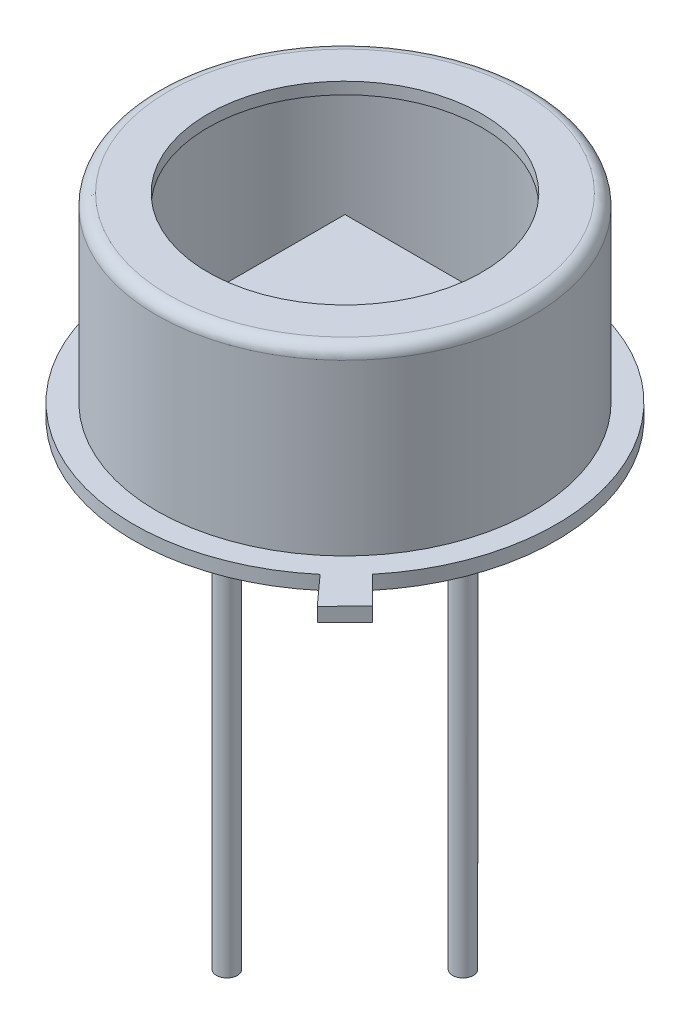
ISO-10303-21;
HEADER;
FILE_DESCRIPTION(('STEP AP214'),'2;1');
FILE_NAME('part.step','',(''),(''),'','','');
FILE_SCHEMA(('AUTOMOTIVE_DESIGN { 1 0 10303 214 1 1 1 1 }'));
ENDSEC;
DATA;
#1=APPLICATION_CONTEXT('core data for automotive mechanical design processes');
#2=APPLICATION_PROTOCOL_DEFINITION('international standard','automotive_design',2000,#1);
#3=PRODUCT_CONTEXT('',#1,'mechanical');
#4=PRODUCT('Part','Part','',(#3));
#5=PRODUCT_RELATED_PRODUCT_CATEGORY('part','',(#4));
#6=PRODUCT_DEFINITION_FORMATION('','',#4);
#7=PRODUCT_DEFINITION_CONTEXT('part definition',#1,'design');
#8=PRODUCT_DEFINITION('design','',#6,#7);
#9=PRODUCT_DEFINITION_SHAPE('','',#8);
#10=(LENGTH_UNIT() NAMED_UNIT(*) SI_UNIT(.MILLI.,.METRE.));
#11=(NAMED_UNIT(*) PLANE_ANGLE_UNIT() SI_UNIT($,.RADIAN.));
#12=(NAMED_UNIT(*) SI_UNIT($,.STERADIAN.) SOLID_ANGLE_UNIT());
#13=UNCERTAINTY_MEASURE_WITH_UNIT(LENGTH_MEASURE(1.E-05),#10,'distance_accuracy_value','');
#14=(GEOMETRIC_REPRESENTATION_CONTEXT(3) GLOBAL_UNCERTAINTY_ASSIGNED_CONTEXT((#13)) GLOBAL_UNIT_ASSIGNED_CONTEXT((#10,
#11,#12)) REPRESENTATION_CONTEXT('',''));
#15=CARTESIAN_POINT('',(0.,0.,0.));
#16=DIRECTION('',(0.,0.,1.));
#17=DIRECTION('',(1.,0.,0.));
#18=AXIS2_PLACEMENT_3D('',#15,#16,#17);
#19=CARTESIAN_POINT('',(-1.5,1.792,1.5));
#20=DIRECTION('',(1.,0.,0.));
#21=DIRECTION('',(0.,0.,-1.));
#22=AXIS2_PLACEMENT_3D('',#19,#20,#21);
#23=PLANE('',#22);
#24=DIRECTION('',(0.,0.,-1.));
#25=VECTOR('',#24,1.);
#26=CARTESIAN_POINT('',(-1.5,2.3,1.5));
#27=LINE('',#26,#25);
#28=CARTESIAN_POINT('',(-1.5,2.3,1.5));
#29=VERTEX_POINT('',#28);
#30=CARTESIAN_POINT('',(-1.5,2.3,-1.5));
#31=VERTEX_POINT('',#30);
#32=EDGE_CURVE('E114',#29,#31,#27,.T.);
#33=ORIENTED_EDGE('',*,*,#32,.T.);
#34=DIRECTION('',(0.,1.,0.));
#35=VECTOR('',#34,1.);
#36=CARTESIAN_POINT('',(-1.5,1.792,-1.5));
#37=LINE('',#36,#35);
#38=CARTESIAN_POINT('',(-1.5,1.792,-1.5));
#39=VERTEX_POINT('',#38);
#40=EDGE_CURVE('E12',#39,#31,#37,.T.);
#41=ORIENTED_EDGE('',*,*,#40,.F.);
#42=DIRECTION('',(0.,0.,-1.));
#43=VECTOR('',#42,1.);
#44=CARTESIAN_POINT('',(-1.5,1.792,1.5));
#45=LINE('',#44,#43);
#46=CARTESIAN_POINT('',(-1.5,1.792,1.5));
#47=VERTEX_POINT('',#46);
#48=EDGE_CURVE('E102',#47,#39,#45,.T.);
#49=ORIENTED_EDGE('',*,*,#48,.F.);
#50=DIRECTION('',(0.,1.,0.));
#51=VECTOR('',#50,1.);
#52=CARTESIAN_POINT('',(-1.5,1.792,1.5));
#53=LINE('',#52,#51);
#54=EDGE_CURVE('E110',#47,#29,#53,.T.);
#55=ORIENTED_EDGE('',*,*,#54,.T.);
#56=EDGE_LOOP('',(#33,#41,#49,#55));
#57=FACE_BOUND('',#56,.T.);
#58=ADVANCED_FACE('F51',(#57),#23,.F.);
#59=CARTESIAN_POINT('',(-1.5,1.792,-1.5));
#60=DIRECTION('',(0.,0.,1.));
#61=DIRECTION('',(1.,0.,0.));
#62=AXIS2_PLACEMENT_3D('',#59,#60,#61);
#63=PLANE('',#62);
#64=DIRECTION('',(1.,0.,0.));
#65=VECTOR('',#64,1.);
#66=CARTESIAN_POINT('',(-1.5,2.3,-1.5));
#67=LINE('',#66,#65);
#68=CARTESIAN_POINT('',(1.5,2.3,-1.5));
#69=VERTEX_POINT('',#68);
#70=EDGE_CURVE('E106',#31,#69,#67,.T.);
#71=ORIENTED_EDGE('',*,*,#70,.T.);
#72=DIRECTION('',(0.,1.,0.));
#73=VECTOR('',#72,1.);
#74=CARTESIAN_POINT('',(1.5,1.792,-1.5));
#75=LINE('',#74,#73);
#76=CARTESIAN_POINT('',(1.5,1.792,-1.5));
#77=VERTEX_POINT('',#76);
#78=EDGE_CURVE('E59',#77,#69,#75,.T.);
#79=ORIENTED_EDGE('',*,*,#78,.F.);
#80=DIRECTION('',(1.,0.,0.));
#81=VECTOR('',#80,1.);
#82=CARTESIAN_POINT('',(-1.5,1.792,-1.5));
#83=LINE('',#82,#81);
#84=EDGE_CURVE('E97',#39,#77,#83,.T.);
#85=ORIENTED_EDGE('',*,*,#84,.F.);
#86=ORIENTED_EDGE('',*,*,#40,.T.);
#87=EDGE_LOOP('',(#71,#79,#85,#86));
#88=FACE_BOUND('',#87,.T.);
#89=ADVANCED_FACE('F105',(#88),#63,.F.);
#90=CARTESIAN_POINT('',(1.5,1.792,1.5));
#91=DIRECTION('',(-1.,0.,0.));
#92=DIRECTION('',(0.,0.,1.));
#93=AXIS2_PLACEMENT_3D('',#90,#91,#92);
#94=PLANE('',#93);
#95=DIRECTION('',(0.,0.,1.));
#96=VECTOR('',#95,1.);
#97=CARTESIAN_POINT('',(1.5,2.3,1.5));
#98=LINE('',#97,#96);
#99=CARTESIAN_POINT('',(1.5,2.3,1.5));
#100=VERTEX_POINT('',#99);
#101=EDGE_CURVE('E84',#69,#100,#98,.T.);
#102=ORIENTED_EDGE('',*,*,#101,.T.);
#103=DIRECTION('',(0.,1.,0.));
#104=VECTOR('',#103,1.);
#105=CARTESIAN_POINT('',(1.5,1.792,1.5));
#106=LINE('',#105,#104);
#107=CARTESIAN_POINT('',(1.5,1.792,1.5));
#108=VERTEX_POINT('',#107);
#109=EDGE_CURVE('E107',#108,#100,#106,.T.);
#110=ORIENTED_EDGE('',*,*,#109,.F.);
#111=DIRECTION('',(0.,0.,1.));
#112=VECTOR('',#111,1.);
#113=CARTESIAN_POINT('',(1.5,1.792,1.5));
#114=LINE('',#113,#112);
#115=EDGE_CURVE('E100',#77,#108,#114,.T.);
#116=ORIENTED_EDGE('',*,*,#115,.F.);
#117=ORIENTED_EDGE('',*,*,#78,.T.);
#118=EDGE_LOOP('',(#102,#110,#116,#117));
#119=FACE_BOUND('',#118,.T.);
#120=ADVANCED_FACE('F108',(#119),#94,.F.);
#121=CARTESIAN_POINT('',(-1.5,1.792,1.5));
#122=DIRECTION('',(0.,0.,-1.));
#123=DIRECTION('',(-1.,0.,0.));
#124=AXIS2_PLACEMENT_3D('',#121,#122,#123);
#125=PLANE('',#124);
#126=DIRECTION('',(-1.,0.,0.));
#127=VECTOR('',#126,1.);
#128=CARTESIAN_POINT('',(-1.5,2.3,1.5));
#129=LINE('',#128,#127);
#130=EDGE_CURVE('E90',#100,#29,#129,.T.);
#131=ORIENTED_EDGE('',*,*,#130,.T.);
#132=ORIENTED_EDGE('',*,*,#54,.F.);
#133=DIRECTION('',(-1.,0.,0.));
#134=VECTOR('',#133,1.);
#135=CARTESIAN_POINT('',(-1.5,1.792,1.5));
#136=LINE('',#135,#134);
#137=EDGE_CURVE('E67',#108,#47,#136,.T.);
#138=ORIENTED_EDGE('',*,*,#137,.F.);
#139=ORIENTED_EDGE('',*,*,#109,.T.);
#140=EDGE_LOOP('',(#131,#132,#138,#139));
#141=FACE_BOUND('',#140,.T.);
#142=ADVANCED_FACE('F121',(#141),#125,.F.);
#143=CARTESIAN_POINT('',(-1.5,1.792,-1.5));
#144=DIRECTION('',(0.,-1.,0.));
#145=DIRECTION('',(0.,0.,-1.));
#146=AXIS2_PLACEMENT_3D('',#143,#144,#145);
#147=PLANE('',#146);
#148=ORIENTED_EDGE('',*,*,#48,.T.);
#149=ORIENTED_EDGE('',*,*,#84,.T.);
#150=ORIENTED_EDGE('',*,*,#115,.T.);
#151=ORIENTED_EDGE('',*,*,#137,.T.);
#152=EDGE_LOOP('',(#148,#149,#150,#151));
#153=FACE_BOUND('',#152,.T.);
#154=ADVANCED_FACE('F98',(#153),#147,.T.);
#155=CARTESIAN_POINT('',(-1.5,2.3,-1.5));
#156=DIRECTION('',(0.,-1.,0.));
#157=DIRECTION('',(0.,0.,-1.));
#158=AXIS2_PLACEMENT_3D('',#155,#156,#157);
#159=PLANE('',#158);
#160=ORIENTED_EDGE('',*,*,#32,.F.);
#161=ORIENTED_EDGE('',*,*,#130,.F.);
#162=ORIENTED_EDGE('',*,*,#101,.F.);
#163=ORIENTED_EDGE('',*,*,#70,.F.);
#164=EDGE_LOOP('',(#160,#161,#162,#163));
#165=FACE_BOUND('',#164,.T.);
#166=ADVANCED_FACE('F124',(#165),#159,.F.);
#167=CLOSED_SHELL('',(#58,#89,#120,#142,#154,#166));
#168=MANIFOLD_SOLID_BREP('B2',#167);
#169=CARTESIAN_POINT('',(4.55,0.,0.));
#170=DIRECTION('',(0.,1.,0.));
#171=DIRECTION('',(0.,0.,1.));
#172=AXIS2_PLACEMENT_3D('',#169,#170,#171);
#173=PLANE('',#172);
#174=CARTESIAN_POINT('',(-2.54,0.,0.));
#175=DIRECTION('',(0.,1.,0.));
#176=DIRECTION('',(0.,0.,1.));
#177=AXIS2_PLACEMENT_3D('',#174,#175,#176);
#178=CIRCLE('',#177,0.224999999999999);
#179=CARTESIAN_POINT('',(-2.54,0.,0.224999999999999));
#180=VERTEX_POINT('',#179);
#181=EDGE_CURVE('E281',#180,#180,#178,.F.);
#182=ORIENTED_EDGE('',*,*,#181,.F.);
#183=EDGE_LOOP('',(#182));
#184=FACE_BOUND('',#183,.T.);
#185=CARTESIAN_POINT('',(0.,0.,0.));
#186=DIRECTION('',(0.,-1.,0.));
#187=DIRECTION('',(0.,0.,-1.));
#188=AXIS2_PLACEMENT_3D('',#185,#186,#187);
#189=CIRCLE('',#188,4.55);
#190=CARTESIAN_POINT('',(2.93886579784095,0.,3.47355262264453));
#191=VERTEX_POINT('',#190);
#192=CARTESIAN_POINT('',(3.4991505641407,0.,2.90834064880197));
#193=VERTEX_POINT('',#192);
#194=EDGE_CURVE('E198',#191,#193,#189,.T.);
#195=ORIENTED_EDGE('',*,*,#194,.T.);
#196=DIRECTION('',(0.710195552739869,0.,0.70400445798909));
#197=VECTOR('',#196,1.);
#198=CARTESIAN_POINT('',(3.4991505641407,0.,2.90834064880197));
#199=LINE('',#198,#197);
#200=CARTESIAN_POINT('',(4.09684665660265,0.,3.50082635501703));
#201=VERTEX_POINT('',#200);
#202=EDGE_CURVE('E251',#193,#201,#199,.T.);
#203=ORIENTED_EDGE('',*,*,#202,.T.);
#204=DIRECTION('',(-0.70400445798909,0.,0.710195552739869));
#205=VECTOR('',#204,1.);
#206=CARTESIAN_POINT('',(4.09684665660265,0.,3.50082635501703));
#207=LINE('',#206,#205);
#208=CARTESIAN_POINT('',(3.50343561688417,0.,4.09945591846979));
#209=VERTEX_POINT('',#208);
#210=EDGE_CURVE('E247',#201,#209,#207,.T.);
#211=ORIENTED_EDGE('',*,*,#210,.T.);
#212=DIRECTION('',(-0.669788128042024,0.,-0.742552263166682));
#213=VECTOR('',#212,1.);
#214=CARTESIAN_POINT('',(3.50343561688417,0.,4.09945591846979));
#215=LINE('',#214,#213);
#216=EDGE_CURVE('E238',#209,#191,#215,.T.);
#217=ORIENTED_EDGE('',*,*,#216,.T.);
#218=EDGE_LOOP('',(#195,#203,#211,#217));
#219=FACE_BOUND('',#218,.T.);
#220=CARTESIAN_POINT('',(2.54,0.,0.));
#221=DIRECTION('',(0.,1.,0.));
#222=DIRECTION('',(0.,0.,1.));
#223=AXIS2_PLACEMENT_3D('',#220,#221,#222);
#224=CIRCLE('',#223,0.225000000000001);
#225=CARTESIAN_POINT('',(2.54,0.,0.225000000000001));
#226=VERTEX_POINT('',#225);
#227=EDGE_CURVE('E191',#226,#226,#224,.F.);
#228=ORIENTED_EDGE('',*,*,#227,.F.);
#229=EDGE_LOOP('',(#228));
#230=FACE_BOUND('',#229,.T.);
#231=CARTESIAN_POINT('',(0.,0.,2.54));
#232=DIRECTION('',(0.,1.,0.));
#233=DIRECTION('',(0.,0.,1.));
#234=AXIS2_PLACEMENT_3D('',#231,#232,#233);
#235=CIRCLE('',#234,0.75);
#236=CARTESIAN_POINT('',(0.,0.,3.29));
#237=VERTEX_POINT('',#236);
#238=EDGE_CURVE('E49',#237,#237,#235,.F.);
#239=ORIENTED_EDGE('',*,*,#238,.F.);
#240=EDGE_LOOP('',(#239));
#241=FACE_BOUND('',#240,.T.);
#242=ADVANCED_FACE('F183',(#184,#219,#230,#241),#173,.F.);
#243=CARTESIAN_POINT('',(3.796,4.2,0.));
#244=DIRECTION('',(0.,1.,0.));
#245=DIRECTION('',(0.,0.,1.));
#246=AXIS2_PLACEMENT_3D('',#243,#244,#245);
#247=PLANE('',#246);
#248=CARTESIAN_POINT('',(0.,4.2,0.));
#249=DIRECTION('',(0.,-1.,0.));
#250=DIRECTION('',(0.,0.,-1.));
#251=AXIS2_PLACEMENT_3D('',#248,#249,#250);
#252=CIRCLE('',#251,2.95);
#253=CARTESIAN_POINT('',(0.,4.2,-2.95));
#254=VERTEX_POINT('',#253);
#255=EDGE_CURVE('E278',#254,#254,#252,.T.);
#256=ORIENTED_EDGE('',*,*,#255,.T.);
#257=EDGE_LOOP('',(#256));
#258=FACE_BOUND('',#257,.T.);
#259=CARTESIAN_POINT('',(0.,4.2,0.));
#260=DIRECTION('',(0.,-1.,0.));
#261=DIRECTION('',(0.,0.,-1.));
#262=AXIS2_PLACEMENT_3D('',#259,#260,#261);
#263=CIRCLE('',#262,3.796);
#264=CARTESIAN_POINT('',(0.,4.2,-3.796));
#265=VERTEX_POINT('',#264);
#266=EDGE_CURVE('E261',#265,#265,#263,.T.);
#267=ORIENTED_EDGE('',*,*,#266,.F.);
#268=EDGE_LOOP('',(#267));
#269=FACE_BOUND('',#268,.T.);
#270=ADVANCED_FACE('F185',(#258,#269),#247,.T.);
#271=CARTESIAN_POINT('',(0.,0.,0.));
#272=DIRECTION('',(0.,-1.,0.));
#273=DIRECTION('',(0.,0.,-1.));
#274=AXIS2_PLACEMENT_3D('',#271,#272,#273);
#275=CYLINDRICAL_SURFACE('',#274,2.95);
#276=ORIENTED_EDGE('',*,*,#255,.F.);
#277=EDGE_LOOP('',(#276));
#278=FACE_BOUND('',#277,.T.);
#279=CARTESIAN_POINT('',(0.,3.946,0.));
#280=DIRECTION('',(0.,-1.,0.));
#281=DIRECTION('',(0.,0.,-1.));
#282=AXIS2_PLACEMENT_3D('',#279,#280,#281);
#283=CIRCLE('',#282,2.95);
#284=CARTESIAN_POINT('',(0.,3.946,-2.95));
#285=VERTEX_POINT('',#284);
#286=EDGE_CURVE('E275',#285,#285,#283,.T.);
#287=ORIENTED_EDGE('',*,*,#286,.T.);
#288=EDGE_LOOP('',(#287));
#289=FACE_BOUND('',#288,.T.);
#290=ADVANCED_FACE('F326',(#278,#289),#275,.F.);
#291=CARTESIAN_POINT('',(3.796,3.946,0.));
#292=DIRECTION('',(0.,1.,0.));
#293=DIRECTION('',(0.,0.,1.));
#294=AXIS2_PLACEMENT_3D('',#291,#292,#293);
#295=PLANE('',#294);
#296=ORIENTED_EDGE('',*,*,#286,.F.);
#297=EDGE_LOOP('',(#296));
#298=FACE_BOUND('',#297,.T.);
#299=CARTESIAN_POINT('',(0.,3.946,0.));
#300=DIRECTION('',(0.,-1.,0.));
#301=DIRECTION('',(0.,0.,-1.));
#302=AXIS2_PLACEMENT_3D('',#299,#300,#301);
#303=CIRCLE('',#302,3.796);
#304=CARTESIAN_POINT('',(0.,3.946,-3.796));
#305=VERTEX_POINT('',#304);
#306=EDGE_CURVE('E272',#305,#305,#303,.T.);
#307=ORIENTED_EDGE('',*,*,#306,.T.);
#308=EDGE_LOOP('',(#307));
#309=FACE_BOUND('',#308,.T.);
#310=ADVANCED_FACE('F336',(#298,#309),#295,.F.);
#311=CARTESIAN_POINT('',(0.,0.,0.));
#312=DIRECTION('',(0.,-1.,0.));
#313=DIRECTION('',(0.,0.,-1.));
#314=AXIS2_PLACEMENT_3D('',#311,#312,#313);
#315=CYLINDRICAL_SURFACE('',#314,3.796);
#316=ORIENTED_EDGE('',*,*,#306,.F.);
#317=EDGE_LOOP('',(#316));
#318=FACE_BOUND('',#317,.T.);
#319=CARTESIAN_POINT('',(0.,0.0459999999999999,0.));
#320=DIRECTION('',(0.,1.,0.));
#321=DIRECTION('',(0.,0.,1.));
#322=AXIS2_PLACEMENT_3D('',#319,#320,#321);
#323=CIRCLE('',#322,3.796);
#324=CARTESIAN_POINT('',(0.,0.0459999999999999,3.796));
#325=VERTEX_POINT('',#324);
#326=EDGE_CURVE('E258',#325,#325,#323,.F.);
#327=ORIENTED_EDGE('',*,*,#326,.T.);
#328=EDGE_LOOP('',(#327));
#329=FACE_BOUND('',#328,.T.);
#330=ADVANCED_FACE('F333',(#318,#329),#315,.F.);
#331=CARTESIAN_POINT('',(0.,0.,0.));
#332=DIRECTION('',(0.,-1.,0.));
#333=DIRECTION('',(0.,0.,-1.));
#334=AXIS2_PLACEMENT_3D('',#331,#332,#333);
#335=CYLINDRICAL_SURFACE('',#334,4.55);
#336=DIRECTION('',(0.,-1.,0.));
#337=VECTOR('',#336,1.);
#338=CARTESIAN_POINT('',(2.93886579784096,1.96122703291704,3.47355262264452));
#339=LINE('',#338,#337);
#340=CARTESIAN_POINT('',(2.93886579784097,0.3,3.47355262264451));
#341=VERTEX_POINT('',#340);
#342=EDGE_CURVE('E232',#341,#191,#339,.T.);
#343=ORIENTED_EDGE('',*,*,#342,.F.);
#344=CARTESIAN_POINT('',(0.,0.3,0.));
#345=DIRECTION('',(0.,-1.,0.));
#346=DIRECTION('',(0.,0.,-1.));
#347=AXIS2_PLACEMENT_3D('',#344,#345,#346);
#348=CIRCLE('',#347,4.55);
#349=CARTESIAN_POINT('',(3.4991505641407,0.3,2.90834064880197));
#350=VERTEX_POINT('',#349);
#351=EDGE_CURVE('E230',#341,#350,#348,.T.);
#352=ORIENTED_EDGE('',*,*,#351,.T.);
#353=DIRECTION('',(0.,-1.,0.));
#354=VECTOR('',#353,1.);
#355=CARTESIAN_POINT('',(3.4991505641407,1.96122703291704,2.90834064880197));
#356=LINE('',#355,#354);
#357=EDGE_CURVE('E203',#350,#193,#356,.T.);
#358=ORIENTED_EDGE('',*,*,#357,.T.);
#359=ORIENTED_EDGE('',*,*,#194,.F.);
#360=EDGE_LOOP('',(#343,#352,#358,#359));
#361=FACE_BOUND('',#360,.T.);
#362=ADVANCED_FACE('F331',(#361),#335,.T.);
#363=CARTESIAN_POINT('',(4.55,0.3,0.));
#364=DIRECTION('',(0.,1.,0.));
#365=DIRECTION('',(0.,0.,1.));
#366=AXIS2_PLACEMENT_3D('',#363,#364,#365);
#367=PLANE('',#366);
#368=ORIENTED_EDGE('',*,*,#351,.F.);
#369=DIRECTION('',(-0.669788128042024,0.,-0.742552263166682));
#370=VECTOR('',#369,1.);
#371=CARTESIAN_POINT('',(3.50343561688417,0.3,4.09945591846979));
#372=LINE('',#371,#370);
#373=CARTESIAN_POINT('',(3.50343561688417,0.3,4.09945591846979));
#374=VERTEX_POINT('',#373);
#375=EDGE_CURVE('E222',#374,#341,#372,.T.);
#376=ORIENTED_EDGE('',*,*,#375,.F.);
#377=DIRECTION('',(-0.70400445798909,0.,0.710195552739869));
#378=VECTOR('',#377,1.);
#379=CARTESIAN_POINT('',(4.09684665660265,0.3,3.50082635501703));
#380=LINE('',#379,#378);
#381=CARTESIAN_POINT('',(4.09684665660265,0.3,3.50082635501703));
#382=VERTEX_POINT('',#381);
#383=EDGE_CURVE('E228',#382,#374,#380,.T.);
#384=ORIENTED_EDGE('',*,*,#383,.F.);
#385=DIRECTION('',(0.710195552739869,0.,0.70400445798909));
#386=VECTOR('',#385,1.);
#387=CARTESIAN_POINT('',(3.4991505641407,0.3,2.90834064880197));
#388=LINE('',#387,#386);
#389=EDGE_CURVE('E253',#350,#382,#388,.T.);
#390=ORIENTED_EDGE('',*,*,#389,.F.);
#391=EDGE_LOOP('',(#368,#376,#384,#390));
#392=FACE_BOUND('',#391,.T.);
#393=CARTESIAN_POINT('',(0.,0.3,0.));
#394=DIRECTION('',(0.,-1.,0.));
#395=DIRECTION('',(0.,0.,-1.));
#396=AXIS2_PLACEMENT_3D('',#393,#394,#395);
#397=CIRCLE('',#396,4.05);
#398=CARTESIAN_POINT('',(0.,0.3,-4.05));
#399=VERTEX_POINT('',#398);
#400=EDGE_CURVE('E267',#399,#399,#397,.T.);
#401=ORIENTED_EDGE('',*,*,#400,.T.);
#402=EDGE_LOOP('',(#401));
#403=FACE_BOUND('',#402,.T.);
#404=ADVANCED_FACE('F224',(#392,#403),#367,.T.);
#405=CARTESIAN_POINT('',(0.,0.,0.));
#406=DIRECTION('',(0.,-1.,0.));
#407=DIRECTION('',(0.,0.,-1.));
#408=AXIS2_PLACEMENT_3D('',#405,#406,#407);
#409=CYLINDRICAL_SURFACE('',#408,4.05);
#410=CARTESIAN_POINT('',(0.,3.946,0.));
#411=DIRECTION('',(0.,-1.,0.));
#412=DIRECTION('',(0.,0.,-1.));
#413=AXIS2_PLACEMENT_3D('',#410,#411,#412);
#414=CIRCLE('',#413,4.05);
#415=CARTESIAN_POINT('',(0.,3.946,-4.05));
#416=VERTEX_POINT('',#415);
#417=EDGE_CURVE('E264',#416,#416,#414,.T.);
#418=ORIENTED_EDGE('',*,*,#417,.T.);
#419=EDGE_LOOP('',(#418));
#420=FACE_BOUND('',#419,.T.);
#421=ORIENTED_EDGE('',*,*,#400,.F.);
#422=EDGE_LOOP('',(#421));
#423=FACE_BOUND('',#422,.T.);
#424=ADVANCED_FACE('F361',(#420,#423),#409,.T.);
#425=CARTESIAN_POINT('',(0.,3.946,0.));
#426=DIRECTION('',(0.,-1.,0.));
#427=DIRECTION('',(0.,0.,-1.));
#428=AXIS2_PLACEMENT_3D('',#425,#426,#427);
#429=TOROIDAL_SURFACE('',#428,3.796,0.253999999999999);
#430=ORIENTED_EDGE('',*,*,#266,.T.);
#431=EDGE_LOOP('',(#430));
#432=FACE_BOUND('',#431,.T.);
#433=ORIENTED_EDGE('',*,*,#417,.F.);
#434=EDGE_LOOP('',(#433));
#435=FACE_BOUND('',#434,.T.);
#436=ADVANCED_FACE('F354',(#432,#435),#429,.T.);
#437=CARTESIAN_POINT('',(4.55,0.0459999999999999,0.));
#438=DIRECTION('',(0.,1.,0.));
#439=DIRECTION('',(0.,0.,1.));
#440=AXIS2_PLACEMENT_3D('',#437,#438,#439);
#441=PLANE('',#440);
#442=ORIENTED_EDGE('',*,*,#326,.F.);
#443=EDGE_LOOP('',(#442));
#444=FACE_BOUND('',#443,.T.);
#445=ADVANCED_FACE('F352',(#444),#441,.T.);
#446=CARTESIAN_POINT('',(4.09684665660265,1.96122703291704,3.50082635501703));
#447=DIRECTION('',(0.710195552739869,0.,0.70400445798909));
#448=DIRECTION('',(0.70400445798909,0.,-0.710195552739869));
#449=AXIS2_PLACEMENT_3D('',#446,#447,#448);
#450=PLANE('',#449);
#451=DIRECTION('',(0.,-1.,0.));
#452=VECTOR('',#451,1.);
#453=CARTESIAN_POINT('',(4.09684665660265,1.96122703291704,3.50082635501703));
#454=LINE('',#453,#452);
#455=EDGE_CURVE('E245',#382,#201,#454,.T.);
#456=ORIENTED_EDGE('',*,*,#455,.F.);
#457=ORIENTED_EDGE('',*,*,#383,.T.);
#458=DIRECTION('',(0.,-1.,0.));
#459=VECTOR('',#458,1.);
#460=CARTESIAN_POINT('',(3.50343561688417,1.96122703291704,4.09945591846979));
#461=LINE('',#460,#459);
#462=EDGE_CURVE('E233',#374,#209,#461,.T.);
#463=ORIENTED_EDGE('',*,*,#462,.T.);
#464=ORIENTED_EDGE('',*,*,#210,.F.);
#465=EDGE_LOOP('',(#456,#457,#463,#464));
#466=FACE_BOUND('',#465,.T.);
#467=ADVANCED_FACE('F244',(#466),#450,.T.);
#468=CARTESIAN_POINT('',(3.50343561688417,1.96122703291704,4.09945591846979));
#469=DIRECTION('',(-0.742552263166682,0.,0.669788128042024));
#470=DIRECTION('',(0.669788128042024,0.,0.742552263166682));
#471=AXIS2_PLACEMENT_3D('',#468,#469,#470);
#472=PLANE('',#471);
#473=ORIENTED_EDGE('',*,*,#462,.F.);
#474=ORIENTED_EDGE('',*,*,#375,.T.);
#475=ORIENTED_EDGE('',*,*,#342,.T.);
#476=ORIENTED_EDGE('',*,*,#216,.F.);
#477=EDGE_LOOP('',(#473,#474,#475,#476));
#478=FACE_BOUND('',#477,.T.);
#479=ADVANCED_FACE('F236',(#478),#472,.T.);
#480=CARTESIAN_POINT('',(3.4991505641407,1.96122703291704,2.90834064880197));
#481=DIRECTION('',(0.70400445798909,0.,-0.710195552739869));
#482=DIRECTION('',(-0.710195552739869,0.,-0.70400445798909));
#483=AXIS2_PLACEMENT_3D('',#480,#481,#482);
#484=PLANE('',#483);
#485=ORIENTED_EDGE('',*,*,#357,.F.);
#486=ORIENTED_EDGE('',*,*,#389,.T.);
#487=ORIENTED_EDGE('',*,*,#455,.T.);
#488=ORIENTED_EDGE('',*,*,#202,.F.);
#489=EDGE_LOOP('',(#485,#486,#487,#488));
#490=FACE_BOUND('',#489,.T.);
#491=ADVANCED_FACE('F308',(#490),#484,.T.);
#492=CARTESIAN_POINT('',(-2.54,-9.,0.));
#493=DIRECTION('',(0.,1.,0.));
#494=DIRECTION('',(0.,0.,1.));
#495=AXIS2_PLACEMENT_3D('',#492,#493,#494);
#496=CYLINDRICAL_SURFACE('',#495,0.224999999999999);
#497=CARTESIAN_POINT('',(-2.54,-9.,0.));
#498=DIRECTION('',(0.,-1.,0.));
#499=DIRECTION('',(0.,0.,-1.));
#500=AXIS2_PLACEMENT_3D('',#497,#498,#499);
#501=CIRCLE('',#500,0.224999999999999);
#502=CARTESIAN_POINT('',(-2.54,-9.,-0.224999999999999));
#503=VERTEX_POINT('',#502);
#504=EDGE_CURVE('E301',#503,#503,#501,.T.);
#505=ORIENTED_EDGE('',*,*,#504,.F.);
#506=EDGE_LOOP('',(#505));
#507=FACE_BOUND('',#506,.T.);
#508=ORIENTED_EDGE('',*,*,#181,.T.);
#509=EDGE_LOOP('',(#508));
#510=FACE_BOUND('',#509,.T.);
#511=ADVANCED_FACE('F310',(#507,#510),#496,.T.);
#512=CARTESIAN_POINT('',(-2.54,-9.,0.));
#513=DIRECTION('',(0.,-1.,0.));
#514=DIRECTION('',(0.,0.,-1.));
#515=AXIS2_PLACEMENT_3D('',#512,#513,#514);
#516=PLANE('',#515);
#517=ORIENTED_EDGE('',*,*,#504,.T.);
#518=EDGE_LOOP('',(#517));
#519=FACE_BOUND('',#518,.T.);
#520=ADVANCED_FACE('F316',(#519),#516,.T.);
#521=CARTESIAN_POINT('',(2.54,-9.,0.));
#522=DIRECTION('',(0.,1.,0.));
#523=DIRECTION('',(0.,0.,1.));
#524=AXIS2_PLACEMENT_3D('',#521,#522,#523);
#525=CYLINDRICAL_SURFACE('',#524,0.225000000000001);
#526=CARTESIAN_POINT('',(2.54,-9.,0.));
#527=DIRECTION('',(0.,-1.,0.));
#528=DIRECTION('',(0.,0.,-1.));
#529=AXIS2_PLACEMENT_3D('',#526,#527,#528);
#530=CIRCLE('',#529,0.225000000000001);
#531=CARTESIAN_POINT('',(2.54,-9.,-0.225000000000001));
#532=VERTEX_POINT('',#531);
#533=EDGE_CURVE('E292',#532,#532,#530,.T.);
#534=ORIENTED_EDGE('',*,*,#533,.F.);
#535=EDGE_LOOP('',(#534));
#536=FACE_BOUND('',#535,.T.);
#537=ORIENTED_EDGE('',*,*,#227,.T.);
#538=EDGE_LOOP('',(#537));
#539=FACE_BOUND('',#538,.T.);
#540=ADVANCED_FACE('F449',(#536,#539),#525,.T.);
#541=CARTESIAN_POINT('',(2.54,-9.,0.));
#542=DIRECTION('',(0.,-1.,0.));
#543=DIRECTION('',(0.,0.,-1.));
#544=AXIS2_PLACEMENT_3D('',#541,#542,#543);
#545=PLANE('',#544);
#546=ORIENTED_EDGE('',*,*,#533,.T.);
#547=EDGE_LOOP('',(#546));
#548=FACE_BOUND('',#547,.T.);
#549=ADVANCED_FACE('F458',(#548),#545,.T.);
#550=CARTESIAN_POINT('',(0.,-0.4,2.54));
#551=DIRECTION('',(0.,-1.,0.));
#552=DIRECTION('',(0.,0.,-1.));
#553=AXIS2_PLACEMENT_3D('',#550,#551,#552);
#554=PLANE('',#553);
#555=CARTESIAN_POINT('',(0.,-0.4,2.54));
#556=DIRECTION('',(0.,-1.,0.));
#557=DIRECTION('',(0.,0.,-1.));
#558=AXIS2_PLACEMENT_3D('',#555,#556,#557);
#559=CIRCLE('',#558,0.75);
#560=CARTESIAN_POINT('',(0.,-0.4,1.79));
#561=VERTEX_POINT('',#560);
#562=EDGE_CURVE('E288',#561,#561,#559,.T.);
#563=ORIENTED_EDGE('',*,*,#562,.T.);
#564=EDGE_LOOP('',(#563));
#565=FACE_BOUND('',#564,.T.);
#566=CARTESIAN_POINT('',(0.,-0.399999999999999,2.54));
#567=DIRECTION('',(0.,-1.,0.));
#568=DIRECTION('',(0.,0.,-1.));
#569=AXIS2_PLACEMENT_3D('',#566,#567,#568);
#570=CIRCLE('',#569,0.225000000000001);
#571=CARTESIAN_POINT('',(0.,-0.399999999999999,2.315));
#572=VERTEX_POINT('',#571);
#573=EDGE_CURVE('E285',#572,#572,#570,.T.);
#574=ORIENTED_EDGE('',*,*,#573,.F.);
#575=EDGE_LOOP('',(#574));
#576=FACE_BOUND('',#575,.T.);
#577=ADVANCED_FACE('F467',(#565,#576),#554,.T.);
#578=CARTESIAN_POINT('',(0.,-0.4,2.54));
#579=DIRECTION('',(0.,1.,0.));
#580=DIRECTION('',(0.,0.,1.));
#581=AXIS2_PLACEMENT_3D('',#578,#579,#580);
#582=CYLINDRICAL_SURFACE('',#581,0.75);
#583=ORIENTED_EDGE('',*,*,#562,.F.);
#584=EDGE_LOOP('',(#583));
#585=FACE_BOUND('',#584,.T.);
#586=ORIENTED_EDGE('',*,*,#238,.T.);
#587=EDGE_LOOP('',(#586));
#588=FACE_BOUND('',#587,.T.);
#589=ADVANCED_FACE('F486',(#585,#588),#582,.T.);
#590=CARTESIAN_POINT('',(0.,-9.,2.54));
#591=DIRECTION('',(0.,-1.,0.));
#592=DIRECTION('',(0.,0.,-1.));
#593=AXIS2_PLACEMENT_3D('',#590,#591,#592);
#594=PLANE('',#593);
#595=CARTESIAN_POINT('',(0.,-9.,2.54));
#596=DIRECTION('',(0.,-1.,0.));
#597=DIRECTION('',(0.,0.,-1.));
#598=AXIS2_PLACEMENT_3D('',#595,#596,#597);
#599=CIRCLE('',#598,0.225000000000001);
#600=CARTESIAN_POINT('',(0.,-9.,2.315));
#601=VERTEX_POINT('',#600);
#602=EDGE_CURVE('E287',#601,#601,#599,.T.);
#603=ORIENTED_EDGE('',*,*,#602,.T.);
#604=EDGE_LOOP('',(#603));
#605=FACE_BOUND('',#604,.T.);
#606=ADVANCED_FACE('F478',(#605),#594,.T.);
#607=CARTESIAN_POINT('',(0.,-9.,2.54));
#608=DIRECTION('',(0.,1.,0.));
#609=DIRECTION('',(0.,0.,1.));
#610=AXIS2_PLACEMENT_3D('',#607,#608,#609);
#611=CYLINDRICAL_SURFACE('',#610,0.225000000000001);
#612=ORIENTED_EDGE('',*,*,#573,.T.);
#613=EDGE_LOOP('',(#612));
#614=FACE_BOUND('',#613,.T.);
#615=ORIENTED_EDGE('',*,*,#602,.F.);
#616=EDGE_LOOP('',(#615));
#617=FACE_BOUND('',#616,.T.);
#618=ADVANCED_FACE('F472',(#614,#617),#611,.T.);
#619=CLOSED_SHELL('',(#242,#270,#290,#310,#330,#362,#404,#424,#436,#445,#467,#479,#491,#511,
#520,#540,#549,#577,#589,#606,#618));
#620=MANIFOLD_SOLID_BREP('B6',#619);
#621=ADVANCED_BREP_SHAPE_REPRESENTATION('',(#18,#168,#620),#14);
#622=SHAPE_DEFINITION_REPRESENTATION(#9,#621);
ENDSEC;
END-ISO-10303-21;
